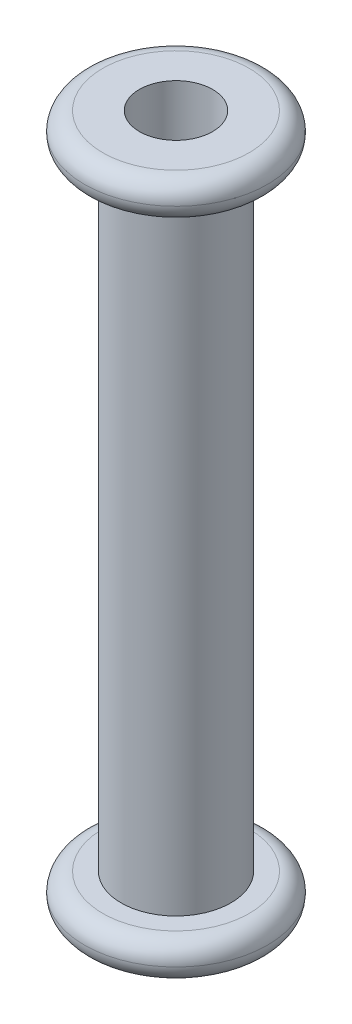
ISO-10303-21;
HEADER;
FILE_DESCRIPTION(('STEP AP214'),'2;1');
FILE_NAME('part.step','',(''),(''),'','','');
FILE_SCHEMA(('AUTOMOTIVE_DESIGN { 1 0 10303 214 1 1 1 1 }'));
ENDSEC;
DATA;
#1=APPLICATION_CONTEXT('core data for automotive mechanical design processes');
#2=APPLICATION_PROTOCOL_DEFINITION('international standard','automotive_design',2000,#1);
#3=PRODUCT_CONTEXT('',#1,'mechanical');
#4=PRODUCT('Part','Part','',(#3));
#5=PRODUCT_RELATED_PRODUCT_CATEGORY('part','',(#4));
#6=PRODUCT_DEFINITION_FORMATION('','',#4);
#7=PRODUCT_DEFINITION_CONTEXT('part definition',#1,'design');
#8=PRODUCT_DEFINITION('design','',#6,#7);
#9=PRODUCT_DEFINITION_SHAPE('','',#8);
#10=(LENGTH_UNIT() NAMED_UNIT(*) SI_UNIT(.MILLI.,.METRE.));
#11=(NAMED_UNIT(*) PLANE_ANGLE_UNIT() SI_UNIT($,.RADIAN.));
#12=(NAMED_UNIT(*) SI_UNIT($,.STERADIAN.) SOLID_ANGLE_UNIT());
#13=UNCERTAINTY_MEASURE_WITH_UNIT(LENGTH_MEASURE(1.E-05),#10,'distance_accuracy_value','');
#14=(GEOMETRIC_REPRESENTATION_CONTEXT(3) GLOBAL_UNCERTAINTY_ASSIGNED_CONTEXT((#13)) GLOBAL_UNIT_ASSIGNED_CONTEXT((#10,
#11,#12)) REPRESENTATION_CONTEXT('',''));
#15=CARTESIAN_POINT('',(0.,0.,0.));
#16=DIRECTION('',(0.,0.,1.));
#17=DIRECTION('',(1.,0.,0.));
#18=AXIS2_PLACEMENT_3D('',#15,#16,#17);
#19=CARTESIAN_POINT('',(0.,38.,0.));
#20=DIRECTION('',(0.,-1.,0.));
#21=DIRECTION('',(0.,0.,-1.));
#22=AXIS2_PLACEMENT_3D('',#19,#20,#21);
#23=CYLINDRICAL_SURFACE('',#22,3.);
#24=CARTESIAN_POINT('',(0.,2.,0.));
#25=DIRECTION('',(0.,-1.,0.));
#26=DIRECTION('',(0.,0.,-1.));
#27=AXIS2_PLACEMENT_3D('',#24,#25,#26);
#28=CIRCLE('',#27,3.);
#29=CARTESIAN_POINT('',(0.,2.,-3.));
#30=VERTEX_POINT('',#29);
#31=EDGE_CURVE('E57',#30,#30,#28,.T.);
#32=ORIENTED_EDGE('',*,*,#31,.F.);
#33=EDGE_LOOP('',(#32));
#34=FACE_BOUND('',#33,.T.);
#35=CARTESIAN_POINT('',(0.,36.,0.));
#36=DIRECTION('',(0.,1.,0.));
#37=DIRECTION('',(0.,0.,1.));
#38=AXIS2_PLACEMENT_3D('',#35,#36,#37);
#39=CIRCLE('',#38,3.);
#40=CARTESIAN_POINT('',(0.,36.,3.));
#41=VERTEX_POINT('',#40);
#42=EDGE_CURVE('E54',#41,#41,#39,.T.);
#43=ORIENTED_EDGE('',*,*,#42,.F.);
#44=EDGE_LOOP('',(#43));
#45=FACE_BOUND('',#44,.T.);
#46=ADVANCED_FACE('F31',(#34,#45),#23,.T.);
#47=CARTESIAN_POINT('',(0.,38.,0.));
#48=DIRECTION('',(0.,1.,0.));
#49=DIRECTION('',(0.,0.,1.));
#50=AXIS2_PLACEMENT_3D('',#47,#48,#49);
#51=PLANE('',#50);
#52=CARTESIAN_POINT('',(0.,38.,0.));
#53=DIRECTION('',(0.,1.,0.));
#54=DIRECTION('',(0.,0.,1.));
#55=AXIS2_PLACEMENT_3D('',#52,#53,#54);
#56=CIRCLE('',#55,4.);
#57=CARTESIAN_POINT('',(0.,38.,4.));
#58=VERTEX_POINT('',#57);
#59=EDGE_CURVE('E10',#58,#58,#56,.T.);
#60=ORIENTED_EDGE('',*,*,#59,.T.);
#61=EDGE_LOOP('',(#60));
#62=FACE_BOUND('',#61,.T.);
#63=CARTESIAN_POINT('',(0.,38.,0.));
#64=DIRECTION('',(0.,1.,0.));
#65=DIRECTION('',(0.,0.,1.));
#66=AXIS2_PLACEMENT_3D('',#63,#64,#65);
#67=CIRCLE('',#66,2.);
#68=CARTESIAN_POINT('',(0.,38.,2.));
#69=VERTEX_POINT('',#68);
#70=EDGE_CURVE('E60',#69,#69,#67,.T.);
#71=ORIENTED_EDGE('',*,*,#70,.F.);
#72=EDGE_LOOP('',(#71));
#73=FACE_BOUND('',#72,.T.);
#74=ADVANCED_FACE('F70',(#62,#73),#51,.T.);
#75=CARTESIAN_POINT('',(0.,0.,0.));
#76=DIRECTION('',(0.,1.,0.));
#77=DIRECTION('',(0.,0.,1.));
#78=AXIS2_PLACEMENT_3D('',#75,#76,#77);
#79=PLANE('',#78);
#80=CARTESIAN_POINT('',(0.,0.,0.));
#81=DIRECTION('',(0.,1.,0.));
#82=DIRECTION('',(0.,0.,1.));
#83=AXIS2_PLACEMENT_3D('',#80,#81,#82);
#84=CIRCLE('',#83,4.);
#85=CARTESIAN_POINT('',(0.,0.,4.));
#86=VERTEX_POINT('',#85);
#87=EDGE_CURVE('E51',#86,#86,#84,.F.);
#88=ORIENTED_EDGE('',*,*,#87,.T.);
#89=EDGE_LOOP('',(#88));
#90=FACE_BOUND('',#89,.T.);
#91=CARTESIAN_POINT('',(0.,0.,0.));
#92=DIRECTION('',(0.,1.,0.));
#93=DIRECTION('',(0.,0.,1.));
#94=AXIS2_PLACEMENT_3D('',#91,#92,#93);
#95=CIRCLE('',#94,2.);
#96=CARTESIAN_POINT('',(0.,0.,2.));
#97=VERTEX_POINT('',#96);
#98=EDGE_CURVE('E61',#97,#97,#95,.T.);
#99=ORIENTED_EDGE('',*,*,#98,.T.);
#100=EDGE_LOOP('',(#99));
#101=FACE_BOUND('',#100,.T.);
#102=ADVANCED_FACE('F72',(#90,#101),#79,.F.);
#103=CARTESIAN_POINT('',(0.,38.,0.));
#104=DIRECTION('',(0.,-1.,0.));
#105=DIRECTION('',(0.,0.,-1.));
#106=AXIS2_PLACEMENT_3D('',#103,#104,#105);
#107=CYLINDRICAL_SURFACE('',#106,2.);
#108=ORIENTED_EDGE('',*,*,#70,.T.);
#109=EDGE_LOOP('',(#108));
#110=FACE_BOUND('',#109,.T.);
#111=ORIENTED_EDGE('',*,*,#98,.F.);
#112=EDGE_LOOP('',(#111));
#113=FACE_BOUND('',#112,.T.);
#114=ADVANCED_FACE('F67',(#110,#113),#107,.F.);
#115=CARTESIAN_POINT('',(0.,2.,0.));
#116=DIRECTION('',(0.,-1.,0.));
#117=DIRECTION('',(0.,0.,-1.));
#118=AXIS2_PLACEMENT_3D('',#115,#116,#117);
#119=PLANE('',#118);
#120=CARTESIAN_POINT('',(0.,2.,0.));
#121=DIRECTION('',(0.,-1.,0.));
#122=DIRECTION('',(0.,0.,-1.));
#123=AXIS2_PLACEMENT_3D('',#120,#121,#122);
#124=CIRCLE('',#123,4.);
#125=CARTESIAN_POINT('',(0.,2.,-4.));
#126=VERTEX_POINT('',#125);
#127=EDGE_CURVE('E43',#126,#126,#124,.F.);
#128=ORIENTED_EDGE('',*,*,#127,.T.);
#129=EDGE_LOOP('',(#128));
#130=FACE_BOUND('',#129,.T.);
#131=ORIENTED_EDGE('',*,*,#31,.T.);
#132=EDGE_LOOP('',(#131));
#133=FACE_BOUND('',#132,.T.);
#134=ADVANCED_FACE('F108',(#130,#133),#119,.F.);
#135=CARTESIAN_POINT('',(0.,36.,0.));
#136=DIRECTION('',(0.,1.,0.));
#137=DIRECTION('',(0.,0.,1.));
#138=AXIS2_PLACEMENT_3D('',#135,#136,#137);
#139=PLANE('',#138);
#140=CARTESIAN_POINT('',(0.,36.,0.));
#141=DIRECTION('',(0.,1.,0.));
#142=DIRECTION('',(0.,0.,1.));
#143=AXIS2_PLACEMENT_3D('',#140,#141,#142);
#144=CIRCLE('',#143,4.);
#145=CARTESIAN_POINT('',(0.,36.,4.));
#146=VERTEX_POINT('',#145);
#147=EDGE_CURVE('E39',#146,#146,#144,.F.);
#148=ORIENTED_EDGE('',*,*,#147,.T.);
#149=EDGE_LOOP('',(#148));
#150=FACE_BOUND('',#149,.T.);
#151=ORIENTED_EDGE('',*,*,#42,.T.);
#152=EDGE_LOOP('',(#151));
#153=FACE_BOUND('',#152,.T.);
#154=ADVANCED_FACE('F89',(#150,#153),#139,.F.);
#155=CARTESIAN_POINT('',(0.,1.,0.));
#156=DIRECTION('',(0.,1.,0.));
#157=DIRECTION('',(0.,0.,1.));
#158=AXIS2_PLACEMENT_3D('',#155,#156,#157);
#159=TOROIDAL_SURFACE('',#158,4.,1.);
#160=CARTESIAN_POINT('',(0.,1.,0.));
#161=DIRECTION('',(0.,1.,0.));
#162=DIRECTION('',(0.,0.,1.));
#163=AXIS2_PLACEMENT_3D('',#160,#161,#162);
#164=CIRCLE('',#163,5.);
#165=CARTESIAN_POINT('',(0.,1.,5.));
#166=VERTEX_POINT('',#165);
#167=EDGE_CURVE('E48',#166,#166,#164,.T.);
#168=ORIENTED_EDGE('',*,*,#167,.F.);
#169=EDGE_LOOP('',(#168));
#170=FACE_BOUND('',#169,.T.);
#171=ORIENTED_EDGE('',*,*,#87,.F.);
#172=EDGE_LOOP('',(#171));
#173=FACE_BOUND('',#172,.T.);
#174=ADVANCED_FACE('F85',(#170,#173),#159,.T.);
#175=CARTESIAN_POINT('',(0.,1.,0.));
#176=DIRECTION('',(0.,-1.,0.));
#177=DIRECTION('',(0.,0.,-1.));
#178=AXIS2_PLACEMENT_3D('',#175,#176,#177);
#179=TOROIDAL_SURFACE('',#178,4.,1.);
#180=ORIENTED_EDGE('',*,*,#127,.F.);
#181=EDGE_LOOP('',(#180));
#182=FACE_BOUND('',#181,.T.);
#183=ORIENTED_EDGE('',*,*,#167,.T.);
#184=EDGE_LOOP('',(#183));
#185=FACE_BOUND('',#184,.T.);
#186=ADVANCED_FACE('F88',(#182,#185),#179,.T.);
#187=CARTESIAN_POINT('',(0.,37.,0.));
#188=DIRECTION('',(0.,1.,0.));
#189=DIRECTION('',(0.,0.,1.));
#190=AXIS2_PLACEMENT_3D('',#187,#188,#189);
#191=TOROIDAL_SURFACE('',#190,4.,1.);
#192=ORIENTED_EDGE('',*,*,#59,.F.);
#193=EDGE_LOOP('',(#192));
#194=FACE_BOUND('',#193,.T.);
#195=CARTESIAN_POINT('',(0.,37.,0.));
#196=DIRECTION('',(0.,1.,0.));
#197=DIRECTION('',(0.,0.,1.));
#198=AXIS2_PLACEMENT_3D('',#195,#196,#197);
#199=CIRCLE('',#198,5.);
#200=CARTESIAN_POINT('',(0.,37.,5.));
#201=VERTEX_POINT('',#200);
#202=EDGE_CURVE('E35',#201,#201,#199,.F.);
#203=ORIENTED_EDGE('',*,*,#202,.F.);
#204=EDGE_LOOP('',(#203));
#205=FACE_BOUND('',#204,.T.);
#206=ADVANCED_FACE('F33',(#194,#205),#191,.T.);
#207=CARTESIAN_POINT('',(0.,37.,0.));
#208=DIRECTION('',(0.,1.,0.));
#209=DIRECTION('',(0.,0.,1.));
#210=AXIS2_PLACEMENT_3D('',#207,#208,#209);
#211=TOROIDAL_SURFACE('',#210,4.,1.);
#212=ORIENTED_EDGE('',*,*,#147,.F.);
#213=EDGE_LOOP('',(#212));
#214=FACE_BOUND('',#213,.T.);
#215=ORIENTED_EDGE('',*,*,#202,.T.);
#216=EDGE_LOOP('',(#215));
#217=FACE_BOUND('',#216,.T.);
#218=ADVANCED_FACE('F93',(#214,#217),#211,.T.);
#219=CLOSED_SHELL('',(#46,#74,#102,#114,#134,#154,#174,#186,#206,#218));
#220=MANIFOLD_SOLID_BREP('B2',#219);
#221=ADVANCED_BREP_SHAPE_REPRESENTATION('',(#18,#220),#14);
#222=SHAPE_DEFINITION_REPRESENTATION(#9,#221);
ENDSEC;
END-ISO-10303-21;
